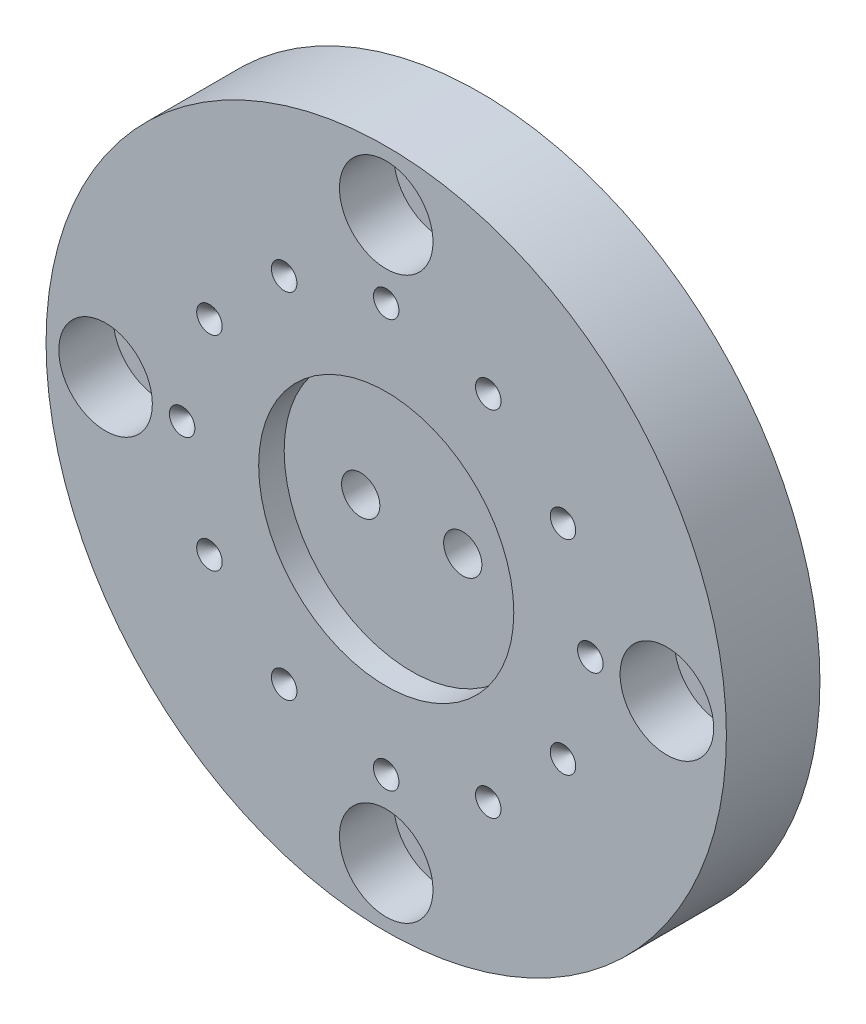
ISO-10303-21;
HEADER;
FILE_DESCRIPTION(('STEP AP214'),'2;1');
FILE_NAME('part.step','',(''),(''),'','','');
FILE_SCHEMA(('AUTOMOTIVE_DESIGN { 1 0 10303 214 1 1 1 1 }'));
ENDSEC;
DATA;
#1=APPLICATION_CONTEXT('core data for automotive mechanical design processes');
#2=APPLICATION_PROTOCOL_DEFINITION('international standard','automotive_design',2000,#1);
#3=PRODUCT_CONTEXT('',#1,'mechanical');
#4=PRODUCT('Part','Part','',(#3));
#5=PRODUCT_RELATED_PRODUCT_CATEGORY('part','',(#4));
#6=PRODUCT_DEFINITION_FORMATION('','',#4);
#7=PRODUCT_DEFINITION_CONTEXT('part definition',#1,'design');
#8=PRODUCT_DEFINITION('design','',#6,#7);
#9=PRODUCT_DEFINITION_SHAPE('','',#8);
#10=(LENGTH_UNIT() NAMED_UNIT(*) SI_UNIT(.MILLI.,.METRE.));
#11=(NAMED_UNIT(*) PLANE_ANGLE_UNIT() SI_UNIT($,.RADIAN.));
#12=(NAMED_UNIT(*) SI_UNIT($,.STERADIAN.) SOLID_ANGLE_UNIT());
#13=UNCERTAINTY_MEASURE_WITH_UNIT(LENGTH_MEASURE(1.E-05),#10,'distance_accuracy_value','');
#14=(GEOMETRIC_REPRESENTATION_CONTEXT(3) GLOBAL_UNCERTAINTY_ASSIGNED_CONTEXT((#13)) GLOBAL_UNIT_ASSIGNED_CONTEXT((#10,
#11,#12)) REPRESENTATION_CONTEXT('',''));
#15=CARTESIAN_POINT('',(0.,0.,0.));
#16=DIRECTION('',(0.,0.,1.));
#17=DIRECTION('',(1.,0.,0.));
#18=AXIS2_PLACEMENT_3D('',#15,#16,#17);
#19=CARTESIAN_POINT('',(0.,0.,8.));
#20=DIRECTION('',(0.,0.,1.));
#21=DIRECTION('',(1.,0.,0.));
#22=AXIS2_PLACEMENT_3D('',#19,#20,#21);
#23=PLANE('',#22);
#24=CARTESIAN_POINT('',(-6.,0.,8.));
#25=DIRECTION('',(0.,0.,-1.));
#26=DIRECTION('',(-1.,0.,0.));
#27=AXIS2_PLACEMENT_3D('',#24,#25,#26);
#28=CIRCLE('',#27,2.25);
#29=CARTESIAN_POINT('',(-8.25,0.,8.));
#30=VERTEX_POINT('',#29);
#31=EDGE_CURVE('E227',#30,#30,#28,.T.);
#32=ORIENTED_EDGE('',*,*,#31,.T.);
#33=EDGE_LOOP('',(#32));
#34=FACE_BOUND('',#33,.T.);
#35=CARTESIAN_POINT('',(6.,0.,8.));
#36=DIRECTION('',(0.,0.,-1.));
#37=DIRECTION('',(-1.,0.,0.));
#38=AXIS2_PLACEMENT_3D('',#35,#36,#37);
#39=CIRCLE('',#38,2.25);
#40=CARTESIAN_POINT('',(3.75,0.,8.));
#41=VERTEX_POINT('',#40);
#42=EDGE_CURVE('E229',#41,#41,#39,.T.);
#43=ORIENTED_EDGE('',*,*,#42,.T.);
#44=EDGE_LOOP('',(#43));
#45=FACE_BOUND('',#44,.T.);
#46=CARTESIAN_POINT('',(0.,0.,8.));
#47=DIRECTION('',(0.,0.,1.));
#48=DIRECTION('',(1.,0.,0.));
#49=AXIS2_PLACEMENT_3D('',#46,#47,#48);
#50=CIRCLE('',#49,15.);
#51=CARTESIAN_POINT('',(15.,0.,8.));
#52=VERTEX_POINT('',#51);
#53=EDGE_CURVE('E19',#52,#52,#50,.T.);
#54=ORIENTED_EDGE('',*,*,#53,.T.);
#55=EDGE_LOOP('',(#54));
#56=FACE_BOUND('',#55,.T.);
#57=ADVANCED_FACE('F16',(#34,#45,#56),#23,.T.);
#58=CARTESIAN_POINT('',(-12.,20.78460969083,10.9999999999104));
#59=DIRECTION('',(0.,0.,1.));
#60=DIRECTION('',(1.,0.,0.));
#61=AXIS2_PLACEMENT_3D('',#58,#59,#60);
#62=CONICAL_SURFACE('',#61,1.49999999988113,0.785398163230657);
#63=CARTESIAN_POINT('',(-12.,20.78460969083,11.0000000000241));
#64=DIRECTION('',(0.,0.,1.));
#65=DIRECTION('',(1.,0.,0.));
#66=AXIS2_PLACEMENT_3D('',#63,#64,#65);
#67=CIRCLE('',#66,1.49999999999482);
#68=CARTESIAN_POINT('',(-10.5000000000052,20.78460969083,11.0000000000241));
#69=VERTEX_POINT('',#68);
#70=EDGE_CURVE('E221',#69,#69,#67,.F.);
#71=ORIENTED_EDGE('',*,*,#70,.F.);
#72=EDGE_LOOP('',(#71));
#73=FACE_BOUND('',#72,.T.);
#74=CARTESIAN_POINT('',(-12.,20.78460969083,9.49999999994589));
#75=VERTEX_POINT('',#74);
#76=VERTEX_LOOP('',#75);
#77=FACE_BOUND('',#76,.T.);
#78=ADVANCED_FACE('F62',(#73,#77),#62,.F.);
#79=CARTESIAN_POINT('',(-20.78460969083,12.,10.9999999999104));
#80=DIRECTION('',(0.,0.,1.));
#81=DIRECTION('',(1.,0.,0.));
#82=AXIS2_PLACEMENT_3D('',#79,#80,#81);
#83=CONICAL_SURFACE('',#82,1.49999999989062,0.785398163196167);
#84=CARTESIAN_POINT('',(-20.78460969083,12.,11.0000000000241));
#85=DIRECTION('',(0.,0.,1.));
#86=DIRECTION('',(1.,0.,0.));
#87=AXIS2_PLACEMENT_3D('',#84,#85,#86);
#88=CIRCLE('',#87,1.50000000000431);
#89=CARTESIAN_POINT('',(-19.2846096908257,12.,11.0000000000241));
#90=VERTEX_POINT('',#89);
#91=EDGE_CURVE('E215',#90,#90,#88,.F.);
#92=ORIENTED_EDGE('',*,*,#91,.F.);
#93=EDGE_LOOP('',(#92));
#94=FACE_BOUND('',#93,.T.);
#95=CARTESIAN_POINT('',(-20.78460969083,12.,9.49999999988904));
#96=VERTEX_POINT('',#95);
#97=VERTEX_LOOP('',#96);
#98=FACE_BOUND('',#97,.T.);
#99=ADVANCED_FACE('F64',(#94,#98),#83,.F.);
#100=CARTESIAN_POINT('',(-24.,2.51426483799388E-13,10.9999999999673));
#101=DIRECTION('',(0.,0.,1.));
#102=DIRECTION('',(1.,0.,0.));
#103=AXIS2_PLACEMENT_3D('',#100,#101,#102);
#104=CONICAL_SURFACE('',#103,1.49999999990743,0.785398163283594);
#105=CARTESIAN_POINT('',(-24.,2.51426483799388E-13,11.0000000000241));
#106=DIRECTION('',(0.,0.,1.));
#107=DIRECTION('',(1.,0.,0.));
#108=AXIS2_PLACEMENT_3D('',#105,#106,#107);
#109=CIRCLE('',#108,1.49999999996428);
#110=CARTESIAN_POINT('',(-22.5000000000357,2.51426483799388E-13,11.0000000000241));
#111=VERTEX_POINT('',#110);
#112=EDGE_CURVE('E212',#111,#111,#109,.F.);
#113=ORIENTED_EDGE('',*,*,#112,.F.);
#114=EDGE_LOOP('',(#113));
#115=FACE_BOUND('',#114,.T.);
#116=CARTESIAN_POINT('',(-24.,-5.6843418860808E-11,9.49999999997431));
#117=VERTEX_POINT('',#116);
#118=VERTEX_LOOP('',#117);
#119=FACE_BOUND('',#118,.T.);
#120=ADVANCED_FACE('F71',(#115,#119),#104,.F.);
#121=CARTESIAN_POINT('',(-20.78460969083,-12.,10.9999999999104));
#122=DIRECTION('',(0.,0.,1.));
#123=DIRECTION('',(1.,0.,0.));
#124=AXIS2_PLACEMENT_3D('',#121,#122,#123);
#125=CONICAL_SURFACE('',#124,1.49999999988113,0.785398163230657);
#126=CARTESIAN_POINT('',(-20.78460969083,-12.,11.0000000000241));
#127=DIRECTION('',(0.,0.,1.));
#128=DIRECTION('',(1.,0.,0.));
#129=AXIS2_PLACEMENT_3D('',#126,#127,#128);
#130=CIRCLE('',#129,1.49999999999482);
#131=CARTESIAN_POINT('',(-19.2846096908352,-12.,11.0000000000241));
#132=VERTEX_POINT('',#131);
#133=EDGE_CURVE('E214',#132,#132,#130,.F.);
#134=ORIENTED_EDGE('',*,*,#133,.F.);
#135=EDGE_LOOP('',(#134));
#136=FACE_BOUND('',#135,.T.);
#137=CARTESIAN_POINT('',(-20.78460969083,-12.,9.49999999994589));
#138=VERTEX_POINT('',#137);
#139=VERTEX_LOOP('',#138);
#140=FACE_BOUND('',#139,.T.);
#141=ADVANCED_FACE('F200',(#136,#140),#125,.F.);
#142=CARTESIAN_POINT('',(-12.,-20.78460969083,10.9999999999104));
#143=DIRECTION('',(0.,0.,1.));
#144=DIRECTION('',(1.,0.,0.));
#145=AXIS2_PLACEMENT_3D('',#142,#143,#144);
#146=CONICAL_SURFACE('',#145,1.49999999989062,0.785398163196167);
#147=CARTESIAN_POINT('',(-12.,-20.78460969083,11.0000000000241));
#148=DIRECTION('',(0.,0.,1.));
#149=DIRECTION('',(1.,0.,0.));
#150=AXIS2_PLACEMENT_3D('',#147,#148,#149);
#151=CIRCLE('',#150,1.50000000000431);
#152=CARTESIAN_POINT('',(-10.4999999999957,-20.78460969083,11.0000000000241));
#153=VERTEX_POINT('',#152);
#154=EDGE_CURVE('E218',#153,#153,#151,.F.);
#155=ORIENTED_EDGE('',*,*,#154,.F.);
#156=EDGE_LOOP('',(#155));
#157=FACE_BOUND('',#156,.T.);
#158=CARTESIAN_POINT('',(-12.,-20.78460969083,9.49999999988904));
#159=VERTEX_POINT('',#158);
#160=VERTEX_LOOP('',#159);
#161=FACE_BOUND('',#160,.T.);
#162=ADVANCED_FACE('F196',(#157,#161),#146,.F.);
#163=CARTESIAN_POINT('',(-1.67617655866259E-13,-24.,10.9999999999673));
#164=DIRECTION('',(0.,0.,1.));
#165=DIRECTION('',(1.,0.,0.));
#166=AXIS2_PLACEMENT_3D('',#163,#164,#165);
#167=CONICAL_SURFACE('',#166,1.49999999990752,0.78539816328365);
#168=CARTESIAN_POINT('',(-1.67617655866259E-13,-24.,11.0000000000241));
#169=DIRECTION('',(0.,0.,1.));
#170=DIRECTION('',(1.,0.,0.));
#171=AXIS2_PLACEMENT_3D('',#168,#169,#170);
#172=CIRCLE('',#171,1.49999999996436);
#173=CARTESIAN_POINT('',(1.49999999996419,-24.,11.0000000000241));
#174=VERTEX_POINT('',#173);
#175=EDGE_CURVE('E304',#174,#174,#172,.F.);
#176=ORIENTED_EDGE('',*,*,#175,.F.);
#177=EDGE_LOOP('',(#176));
#178=FACE_BOUND('',#177,.T.);
#179=CARTESIAN_POINT('',(5.6843418860808E-11,-24.,9.49999999997431));
#180=VERTEX_POINT('',#179);
#181=VERTEX_LOOP('',#180);
#182=FACE_BOUND('',#181,.T.);
#183=ADVANCED_FACE('F192',(#178,#182),#167,.F.);
#184=CARTESIAN_POINT('',(12.,-20.78460969083,10.9999999999104));
#185=DIRECTION('',(0.,0.,1.));
#186=DIRECTION('',(1.,0.,0.));
#187=AXIS2_PLACEMENT_3D('',#184,#185,#186);
#188=CONICAL_SURFACE('',#187,1.49999999988113,0.785398163230657);
#189=CARTESIAN_POINT('',(12.,-20.78460969083,11.0000000000241));
#190=DIRECTION('',(0.,0.,1.));
#191=DIRECTION('',(1.,0.,0.));
#192=AXIS2_PLACEMENT_3D('',#189,#190,#191);
#193=CIRCLE('',#192,1.49999999999482);
#194=CARTESIAN_POINT('',(13.4999999999948,-20.78460969083,11.0000000000241));
#195=VERTEX_POINT('',#194);
#196=EDGE_CURVE('E301',#195,#195,#193,.F.);
#197=ORIENTED_EDGE('',*,*,#196,.F.);
#198=EDGE_LOOP('',(#197));
#199=FACE_BOUND('',#198,.T.);
#200=CARTESIAN_POINT('',(12.,-20.78460969083,9.49999999994589));
#201=VERTEX_POINT('',#200);
#202=VERTEX_LOOP('',#201);
#203=FACE_BOUND('',#202,.T.);
#204=ADVANCED_FACE('F188',(#199,#203),#188,.F.);
#205=CARTESIAN_POINT('',(20.78460969083,-12.,10.9999999999104));
#206=DIRECTION('',(0.,0.,1.));
#207=DIRECTION('',(1.,0.,0.));
#208=AXIS2_PLACEMENT_3D('',#205,#206,#207);
#209=CONICAL_SURFACE('',#208,1.49999999989062,0.785398163196167);
#210=CARTESIAN_POINT('',(20.78460969083,-12.,11.0000000000241));
#211=DIRECTION('',(0.,0.,1.));
#212=DIRECTION('',(1.,0.,0.));
#213=AXIS2_PLACEMENT_3D('',#210,#211,#212);
#214=CIRCLE('',#213,1.50000000000431);
#215=CARTESIAN_POINT('',(22.2846096908343,-12.,11.0000000000241));
#216=VERTEX_POINT('',#215);
#217=EDGE_CURVE('E298',#216,#216,#214,.F.);
#218=ORIENTED_EDGE('',*,*,#217,.F.);
#219=EDGE_LOOP('',(#218));
#220=FACE_BOUND('',#219,.T.);
#221=CARTESIAN_POINT('',(20.78460969083,-12.,9.49999999988904));
#222=VERTEX_POINT('',#221);
#223=VERTEX_LOOP('',#222);
#224=FACE_BOUND('',#223,.T.);
#225=ADVANCED_FACE('F184',(#220,#224),#209,.F.);
#226=CARTESIAN_POINT('',(24.,0.,10.9999999999673));
#227=DIRECTION('',(0.,0.,1.));
#228=DIRECTION('',(1.,0.,0.));
#229=AXIS2_PLACEMENT_3D('',#226,#227,#228);
#230=CONICAL_SURFACE('',#229,1.4999999999076,0.785398163283706);
#231=CARTESIAN_POINT('',(24.,0.,11.0000000000241));
#232=DIRECTION('',(0.,0.,1.));
#233=DIRECTION('',(1.,0.,0.));
#234=AXIS2_PLACEMENT_3D('',#231,#232,#233);
#235=CIRCLE('',#234,1.49999999996445);
#236=CARTESIAN_POINT('',(25.4999999999644,0.,11.0000000000241));
#237=VERTEX_POINT('',#236);
#238=EDGE_CURVE('E295',#237,#237,#235,.F.);
#239=ORIENTED_EDGE('',*,*,#238,.F.);
#240=EDGE_LOOP('',(#239));
#241=FACE_BOUND('',#240,.T.);
#242=CARTESIAN_POINT('',(24.,5.6843418860808E-11,9.49999999997431));
#243=VERTEX_POINT('',#242);
#244=VERTEX_LOOP('',#243);
#245=FACE_BOUND('',#244,.T.);
#246=ADVANCED_FACE('F180',(#241,#245),#230,.F.);
#247=CARTESIAN_POINT('',(20.78460969083,12.,10.9999999999104));
#248=DIRECTION('',(0.,0.,1.));
#249=DIRECTION('',(1.,0.,0.));
#250=AXIS2_PLACEMENT_3D('',#247,#248,#249);
#251=CONICAL_SURFACE('',#250,1.49999999988113,0.785398163230657);
#252=CARTESIAN_POINT('',(20.78460969083,12.,11.0000000000241));
#253=DIRECTION('',(0.,0.,1.));
#254=DIRECTION('',(1.,0.,0.));
#255=AXIS2_PLACEMENT_3D('',#252,#253,#254);
#256=CIRCLE('',#255,1.49999999999482);
#257=CARTESIAN_POINT('',(22.2846096908248,12.,11.0000000000241));
#258=VERTEX_POINT('',#257);
#259=EDGE_CURVE('E292',#258,#258,#256,.F.);
#260=ORIENTED_EDGE('',*,*,#259,.F.);
#261=EDGE_LOOP('',(#260));
#262=FACE_BOUND('',#261,.T.);
#263=CARTESIAN_POINT('',(20.78460969083,12.,9.49999999994589));
#264=VERTEX_POINT('',#263);
#265=VERTEX_LOOP('',#264);
#266=FACE_BOUND('',#265,.T.);
#267=ADVANCED_FACE('F176',(#262,#266),#251,.F.);
#268=CARTESIAN_POINT('',(12.,20.78460969083,10.9999999999104));
#269=DIRECTION('',(0.,0.,1.));
#270=DIRECTION('',(1.,0.,0.));
#271=AXIS2_PLACEMENT_3D('',#268,#269,#270);
#272=CONICAL_SURFACE('',#271,1.49999999989062,0.785398163196167);
#273=CARTESIAN_POINT('',(12.,20.78460969083,11.0000000000241));
#274=DIRECTION('',(0.,0.,1.));
#275=DIRECTION('',(1.,0.,0.));
#276=AXIS2_PLACEMENT_3D('',#273,#274,#275);
#277=CIRCLE('',#276,1.50000000000431);
#278=CARTESIAN_POINT('',(13.5000000000043,20.78460969083,11.0000000000241));
#279=VERTEX_POINT('',#278);
#280=EDGE_CURVE('E289',#279,#279,#277,.F.);
#281=ORIENTED_EDGE('',*,*,#280,.F.);
#282=EDGE_LOOP('',(#281));
#283=FACE_BOUND('',#282,.T.);
#284=CARTESIAN_POINT('',(12.,20.78460969083,9.49999999988904));
#285=VERTEX_POINT('',#284);
#286=VERTEX_LOOP('',#285);
#287=FACE_BOUND('',#286,.T.);
#288=ADVANCED_FACE('F172',(#283,#287),#272,.F.);
#289=CARTESIAN_POINT('',(0.,0.,8.));
#290=DIRECTION('',(0.,0.,1.));
#291=DIRECTION('',(1.,0.,0.));
#292=AXIS2_PLACEMENT_3D('',#289,#290,#291);
#293=CYLINDRICAL_SURFACE('',#292,15.);
#294=CARTESIAN_POINT('',(0.,0.,11.));
#295=DIRECTION('',(0.,0.,1.));
#296=DIRECTION('',(1.,0.,0.));
#297=AXIS2_PLACEMENT_3D('',#294,#295,#296);
#298=CIRCLE('',#297,15.);
#299=CARTESIAN_POINT('',(15.,0.,11.));
#300=VERTEX_POINT('',#299);
#301=EDGE_CURVE('E277',#300,#300,#298,.F.);
#302=ORIENTED_EDGE('',*,*,#301,.F.);
#303=EDGE_LOOP('',(#302));
#304=FACE_BOUND('',#303,.T.);
#305=ORIENTED_EDGE('',*,*,#53,.F.);
#306=EDGE_LOOP('',(#305));
#307=FACE_BOUND('',#306,.T.);
#308=ADVANCED_FACE('F168',(#304,#307),#293,.F.);
#309=CARTESIAN_POINT('',(0.,24.,10.9999999999673));
#310=DIRECTION('',(0.,0.,1.));
#311=DIRECTION('',(1.,0.,0.));
#312=AXIS2_PLACEMENT_3D('',#309,#310,#311);
#313=CONICAL_SURFACE('',#312,1.49999999990769,0.785398163283761);
#314=CARTESIAN_POINT('',(0.,24.,11.0000000000241));
#315=DIRECTION('',(0.,0.,1.));
#316=DIRECTION('',(1.,0.,0.));
#317=AXIS2_PLACEMENT_3D('',#314,#315,#316);
#318=CIRCLE('',#317,1.49999999996453);
#319=CARTESIAN_POINT('',(1.49999999996453,24.,11.0000000000241));
#320=VERTEX_POINT('',#319);
#321=EDGE_CURVE('E271',#320,#320,#318,.F.);
#322=ORIENTED_EDGE('',*,*,#321,.F.);
#323=EDGE_LOOP('',(#322));
#324=FACE_BOUND('',#323,.T.);
#325=CARTESIAN_POINT('',(-5.6843418860808E-11,24.,9.49999999997431));
#326=VERTEX_POINT('',#325);
#327=VERTEX_LOOP('',#326);
#328=FACE_BOUND('',#327,.T.);
#329=ADVANCED_FACE('F164',(#324,#328),#313,.F.);
#330=CARTESIAN_POINT('',(-3.456568527498E-13,-33.,11.));
#331=DIRECTION('',(0.,0.,1.));
#332=DIRECTION('',(1.,0.,0.));
#333=AXIS2_PLACEMENT_3D('',#330,#331,#332);
#334=CYLINDRICAL_SURFACE('',#333,5.5);
#335=CARTESIAN_POINT('',(-3.456568527498E-13,-33.,11.));
#336=DIRECTION('',(0.,0.,1.));
#337=DIRECTION('',(1.,0.,0.));
#338=AXIS2_PLACEMENT_3D('',#335,#336,#337);
#339=CIRCLE('',#338,5.5);
#340=CARTESIAN_POINT('',(5.49999999999965,-33.,11.));
#341=VERTEX_POINT('',#340);
#342=EDGE_CURVE('E286',#341,#341,#339,.F.);
#343=ORIENTED_EDGE('',*,*,#342,.F.);
#344=EDGE_LOOP('',(#343));
#345=FACE_BOUND('',#344,.T.);
#346=CARTESIAN_POINT('',(-3.456568527498E-13,-33.,4.6));
#347=DIRECTION('',(0.,0.,1.));
#348=DIRECTION('',(1.,0.,0.));
#349=AXIS2_PLACEMENT_3D('',#346,#347,#348);
#350=CIRCLE('',#349,5.5);
#351=CARTESIAN_POINT('',(5.49999999999965,-33.,4.6));
#352=VERTEX_POINT('',#351);
#353=EDGE_CURVE('E268',#352,#352,#350,.F.);
#354=ORIENTED_EDGE('',*,*,#353,.T.);
#355=EDGE_LOOP('',(#354));
#356=FACE_BOUND('',#355,.T.);
#357=ADVANCED_FACE('F160',(#345,#356),#334,.F.);
#358=CARTESIAN_POINT('',(33.,-2.304379018332E-13,11.));
#359=DIRECTION('',(0.,0.,1.));
#360=DIRECTION('',(1.,0.,0.));
#361=AXIS2_PLACEMENT_3D('',#358,#359,#360);
#362=CYLINDRICAL_SURFACE('',#361,5.5);
#363=CARTESIAN_POINT('',(33.,-2.304379018332E-13,11.));
#364=DIRECTION('',(0.,0.,1.));
#365=DIRECTION('',(1.,0.,0.));
#366=AXIS2_PLACEMENT_3D('',#363,#364,#365);
#367=CIRCLE('',#366,5.5);
#368=CARTESIAN_POINT('',(38.5,-2.304379018332E-13,11.));
#369=VERTEX_POINT('',#368);
#370=EDGE_CURVE('E283',#369,#369,#367,.F.);
#371=ORIENTED_EDGE('',*,*,#370,.F.);
#372=EDGE_LOOP('',(#371));
#373=FACE_BOUND('',#372,.T.);
#374=CARTESIAN_POINT('',(33.,-2.304379018332E-13,4.6));
#375=DIRECTION('',(0.,0.,1.));
#376=DIRECTION('',(1.,0.,0.));
#377=AXIS2_PLACEMENT_3D('',#374,#375,#376);
#378=CIRCLE('',#377,5.5);
#379=CARTESIAN_POINT('',(38.5,-2.304379018332E-13,4.6));
#380=VERTEX_POINT('',#379);
#381=EDGE_CURVE('E265',#380,#380,#378,.F.);
#382=ORIENTED_EDGE('',*,*,#381,.T.);
#383=EDGE_LOOP('',(#382));
#384=FACE_BOUND('',#383,.T.);
#385=ADVANCED_FACE('F156',(#373,#384),#362,.F.);
#386=CARTESIAN_POINT('',(1.152189509166E-13,33.,11.));
#387=DIRECTION('',(0.,0.,1.));
#388=DIRECTION('',(1.,0.,0.));
#389=AXIS2_PLACEMENT_3D('',#386,#387,#388);
#390=CYLINDRICAL_SURFACE('',#389,5.5);
#391=CARTESIAN_POINT('',(1.152189509166E-13,33.,11.));
#392=DIRECTION('',(0.,0.,1.));
#393=DIRECTION('',(1.,0.,0.));
#394=AXIS2_PLACEMENT_3D('',#391,#392,#393);
#395=CIRCLE('',#394,5.5);
#396=CARTESIAN_POINT('',(5.50000000000012,33.,11.));
#397=VERTEX_POINT('',#396);
#398=EDGE_CURVE('E280',#397,#397,#395,.F.);
#399=ORIENTED_EDGE('',*,*,#398,.F.);
#400=EDGE_LOOP('',(#399));
#401=FACE_BOUND('',#400,.T.);
#402=CARTESIAN_POINT('',(1.152189509166E-13,33.,4.6));
#403=DIRECTION('',(0.,0.,1.));
#404=DIRECTION('',(1.,0.,0.));
#405=AXIS2_PLACEMENT_3D('',#402,#403,#404);
#406=CIRCLE('',#405,5.5);
#407=CARTESIAN_POINT('',(5.50000000000012,33.,4.6));
#408=VERTEX_POINT('',#407);
#409=EDGE_CURVE('E262',#408,#408,#406,.F.);
#410=ORIENTED_EDGE('',*,*,#409,.T.);
#411=EDGE_LOOP('',(#410));
#412=FACE_BOUND('',#411,.T.);
#413=ADVANCED_FACE('F152',(#401,#412),#390,.F.);
#414=CARTESIAN_POINT('',(6.,0.,0.));
#415=DIRECTION('',(0.,0.,-1.));
#416=DIRECTION('',(-1.,0.,0.));
#417=AXIS2_PLACEMENT_3D('',#414,#415,#416);
#418=CYLINDRICAL_SURFACE('',#417,2.25);
#419=CARTESIAN_POINT('',(6.,0.,4.4));
#420=DIRECTION('',(0.,0.,-1.));
#421=DIRECTION('',(-1.,0.,0.));
#422=AXIS2_PLACEMENT_3D('',#419,#420,#421);
#423=CIRCLE('',#422,2.25);
#424=CARTESIAN_POINT('',(3.75,0.,4.4));
#425=VERTEX_POINT('',#424);
#426=EDGE_CURVE('E259',#425,#425,#423,.T.);
#427=ORIENTED_EDGE('',*,*,#426,.T.);
#428=EDGE_LOOP('',(#427));
#429=FACE_BOUND('',#428,.T.);
#430=ORIENTED_EDGE('',*,*,#42,.F.);
#431=EDGE_LOOP('',(#430));
#432=FACE_BOUND('',#431,.T.);
#433=ADVANCED_FACE('F148',(#429,#432),#418,.F.);
#434=CARTESIAN_POINT('',(-6.,0.,0.));
#435=DIRECTION('',(0.,0.,-1.));
#436=DIRECTION('',(-1.,0.,0.));
#437=AXIS2_PLACEMENT_3D('',#434,#435,#436);
#438=CYLINDRICAL_SURFACE('',#437,2.25);
#439=CARTESIAN_POINT('',(-6.,0.,4.4));
#440=DIRECTION('',(0.,0.,-1.));
#441=DIRECTION('',(-1.,0.,0.));
#442=AXIS2_PLACEMENT_3D('',#439,#440,#441);
#443=CIRCLE('',#442,2.25);
#444=CARTESIAN_POINT('',(-8.25,0.,4.4));
#445=VERTEX_POINT('',#444);
#446=EDGE_CURVE('E253',#445,#445,#443,.T.);
#447=ORIENTED_EDGE('',*,*,#446,.T.);
#448=EDGE_LOOP('',(#447));
#449=FACE_BOUND('',#448,.T.);
#450=ORIENTED_EDGE('',*,*,#31,.F.);
#451=EDGE_LOOP('',(#450));
#452=FACE_BOUND('',#451,.T.);
#453=ADVANCED_FACE('F144',(#449,#452),#438,.F.);
#454=CARTESIAN_POINT('',(-33.,0.,11.));
#455=DIRECTION('',(0.,0.,1.));
#456=DIRECTION('',(1.,0.,0.));
#457=AXIS2_PLACEMENT_3D('',#454,#455,#456);
#458=CYLINDRICAL_SURFACE('',#457,5.5);
#459=CARTESIAN_POINT('',(-33.,0.,11.));
#460=DIRECTION('',(0.,0.,1.));
#461=DIRECTION('',(1.,0.,0.));
#462=AXIS2_PLACEMENT_3D('',#459,#460,#461);
#463=CIRCLE('',#462,5.5);
#464=CARTESIAN_POINT('',(-27.5,0.,11.));
#465=VERTEX_POINT('',#464);
#466=EDGE_CURVE('E274',#465,#465,#463,.F.);
#467=ORIENTED_EDGE('',*,*,#466,.F.);
#468=EDGE_LOOP('',(#467));
#469=FACE_BOUND('',#468,.T.);
#470=CARTESIAN_POINT('',(-33.,0.,4.6));
#471=DIRECTION('',(0.,0.,1.));
#472=DIRECTION('',(1.,0.,0.));
#473=AXIS2_PLACEMENT_3D('',#470,#471,#472);
#474=CIRCLE('',#473,5.5);
#475=CARTESIAN_POINT('',(-27.5,0.,4.6));
#476=VERTEX_POINT('',#475);
#477=EDGE_CURVE('E247',#476,#476,#474,.F.);
#478=ORIENTED_EDGE('',*,*,#477,.T.);
#479=EDGE_LOOP('',(#478));
#480=FACE_BOUND('',#479,.T.);
#481=ADVANCED_FACE('F140',(#469,#480),#458,.F.);
#482=CARTESIAN_POINT('',(0.,0.,11.));
#483=DIRECTION('',(0.,0.,1.));
#484=DIRECTION('',(1.,0.,0.));
#485=AXIS2_PLACEMENT_3D('',#482,#483,#484);
#486=PLANE('',#485);
#487=ORIENTED_EDGE('',*,*,#321,.T.);
#488=EDGE_LOOP('',(#487));
#489=FACE_BOUND('',#488,.T.);
#490=ORIENTED_EDGE('',*,*,#466,.T.);
#491=EDGE_LOOP('',(#490));
#492=FACE_BOUND('',#491,.T.);
#493=ORIENTED_EDGE('',*,*,#301,.T.);
#494=EDGE_LOOP('',(#493));
#495=FACE_BOUND('',#494,.T.);
#496=ORIENTED_EDGE('',*,*,#398,.T.);
#497=EDGE_LOOP('',(#496));
#498=FACE_BOUND('',#497,.T.);
#499=ORIENTED_EDGE('',*,*,#370,.T.);
#500=EDGE_LOOP('',(#499));
#501=FACE_BOUND('',#500,.T.);
#502=ORIENTED_EDGE('',*,*,#342,.T.);
#503=EDGE_LOOP('',(#502));
#504=FACE_BOUND('',#503,.T.);
#505=ORIENTED_EDGE('',*,*,#280,.T.);
#506=EDGE_LOOP('',(#505));
#507=FACE_BOUND('',#506,.T.);
#508=ORIENTED_EDGE('',*,*,#259,.T.);
#509=EDGE_LOOP('',(#508));
#510=FACE_BOUND('',#509,.T.);
#511=ORIENTED_EDGE('',*,*,#238,.T.);
#512=EDGE_LOOP('',(#511));
#513=FACE_BOUND('',#512,.T.);
#514=ORIENTED_EDGE('',*,*,#217,.T.);
#515=EDGE_LOOP('',(#514));
#516=FACE_BOUND('',#515,.T.);
#517=ORIENTED_EDGE('',*,*,#196,.T.);
#518=EDGE_LOOP('',(#517));
#519=FACE_BOUND('',#518,.T.);
#520=ORIENTED_EDGE('',*,*,#175,.T.);
#521=EDGE_LOOP('',(#520));
#522=FACE_BOUND('',#521,.T.);
#523=ORIENTED_EDGE('',*,*,#154,.T.);
#524=EDGE_LOOP('',(#523));
#525=FACE_BOUND('',#524,.T.);
#526=ORIENTED_EDGE('',*,*,#133,.T.);
#527=EDGE_LOOP('',(#526));
#528=FACE_BOUND('',#527,.T.);
#529=ORIENTED_EDGE('',*,*,#112,.T.);
#530=EDGE_LOOP('',(#529));
#531=FACE_BOUND('',#530,.T.);
#532=ORIENTED_EDGE('',*,*,#91,.T.);
#533=EDGE_LOOP('',(#532));
#534=FACE_BOUND('',#533,.T.);
#535=ORIENTED_EDGE('',*,*,#70,.T.);
#536=EDGE_LOOP('',(#535));
#537=FACE_BOUND('',#536,.T.);
#538=CARTESIAN_POINT('',(0.,0.,11.));
#539=DIRECTION('',(0.,0.,-1.));
#540=DIRECTION('',(-1.,0.,0.));
#541=AXIS2_PLACEMENT_3D('',#538,#539,#540);
#542=CIRCLE('',#541,40.);
#543=CARTESIAN_POINT('',(-40.,0.,11.));
#544=VERTEX_POINT('',#543);
#545=EDGE_CURVE('E244',#544,#544,#542,.T.);
#546=ORIENTED_EDGE('',*,*,#545,.F.);
#547=EDGE_LOOP('',(#546));
#548=FACE_BOUND('',#547,.T.);
#549=ADVANCED_FACE('F136',(#489,#492,#495,#498,#501,#504,#507,#510,#513,#516,#519,#522,#525,
#528,#531,#534,#537,#548),#486,.T.);
#550=CARTESIAN_POINT('',(3.3,-33.,4.6));
#551=DIRECTION('',(0.,0.,-1.));
#552=DIRECTION('',(-1.,0.,0.));
#553=AXIS2_PLACEMENT_3D('',#550,#551,#552);
#554=PLANE('',#553);
#555=CARTESIAN_POINT('',(-3.456568527498E-13,-33.,4.6));
#556=DIRECTION('',(0.,0.,1.));
#557=DIRECTION('',(1.,0.,0.));
#558=AXIS2_PLACEMENT_3D('',#555,#556,#557);
#559=CIRCLE('',#558,3.3);
#560=CARTESIAN_POINT('',(3.29999999999965,-33.,4.6));
#561=VERTEX_POINT('',#560);
#562=EDGE_CURVE('E246',#561,#561,#559,.F.);
#563=ORIENTED_EDGE('',*,*,#562,.T.);
#564=EDGE_LOOP('',(#563));
#565=FACE_BOUND('',#564,.T.);
#566=ORIENTED_EDGE('',*,*,#353,.F.);
#567=EDGE_LOOP('',(#566));
#568=FACE_BOUND('',#567,.T.);
#569=ADVANCED_FACE('F132',(#565,#568),#554,.F.);
#570=CARTESIAN_POINT('',(36.3,-2.304379018332E-13,4.6));
#571=DIRECTION('',(0.,0.,-1.));
#572=DIRECTION('',(-1.,0.,0.));
#573=AXIS2_PLACEMENT_3D('',#570,#571,#572);
#574=PLANE('',#573);
#575=CARTESIAN_POINT('',(33.,-2.304379018332E-13,4.6));
#576=DIRECTION('',(0.,0.,1.));
#577=DIRECTION('',(1.,0.,0.));
#578=AXIS2_PLACEMENT_3D('',#575,#576,#577);
#579=CIRCLE('',#578,3.3);
#580=CARTESIAN_POINT('',(36.3,-2.304379018332E-13,4.6));
#581=VERTEX_POINT('',#580);
#582=EDGE_CURVE('E250',#581,#581,#579,.F.);
#583=ORIENTED_EDGE('',*,*,#582,.T.);
#584=EDGE_LOOP('',(#583));
#585=FACE_BOUND('',#584,.T.);
#586=ORIENTED_EDGE('',*,*,#381,.F.);
#587=EDGE_LOOP('',(#586));
#588=FACE_BOUND('',#587,.T.);
#589=ADVANCED_FACE('F128',(#585,#588),#574,.F.);
#590=CARTESIAN_POINT('',(3.3,33.,4.6));
#591=DIRECTION('',(0.,0.,-1.));
#592=DIRECTION('',(-1.,0.,0.));
#593=AXIS2_PLACEMENT_3D('',#590,#591,#592);
#594=PLANE('',#593);
#595=CARTESIAN_POINT('',(1.152189509166E-13,33.,4.6));
#596=DIRECTION('',(0.,0.,1.));
#597=DIRECTION('',(1.,0.,0.));
#598=AXIS2_PLACEMENT_3D('',#595,#596,#597);
#599=CIRCLE('',#598,3.3);
#600=CARTESIAN_POINT('',(3.30000000000012,33.,4.6));
#601=VERTEX_POINT('',#600);
#602=EDGE_CURVE('E363',#601,#601,#599,.F.);
#603=ORIENTED_EDGE('',*,*,#602,.T.);
#604=EDGE_LOOP('',(#603));
#605=FACE_BOUND('',#604,.T.);
#606=ORIENTED_EDGE('',*,*,#409,.F.);
#607=EDGE_LOOP('',(#606));
#608=FACE_BOUND('',#607,.T.);
#609=ADVANCED_FACE('F124',(#605,#608),#594,.F.);
#610=CARTESIAN_POINT('',(8.25,0.,4.4));
#611=DIRECTION('',(0.,0.,1.));
#612=DIRECTION('',(1.,0.,0.));
#613=AXIS2_PLACEMENT_3D('',#610,#611,#612);
#614=PLANE('',#613);
#615=ORIENTED_EDGE('',*,*,#426,.F.);
#616=EDGE_LOOP('',(#615));
#617=FACE_BOUND('',#616,.T.);
#618=CARTESIAN_POINT('',(6.,0.,4.4));
#619=DIRECTION('',(0.,0.,-1.));
#620=DIRECTION('',(-1.,0.,0.));
#621=AXIS2_PLACEMENT_3D('',#618,#619,#620);
#622=CIRCLE('',#621,3.75);
#623=CARTESIAN_POINT('',(2.25,0.,4.4));
#624=VERTEX_POINT('',#623);
#625=EDGE_CURVE('E360',#624,#624,#622,.T.);
#626=ORIENTED_EDGE('',*,*,#625,.T.);
#627=EDGE_LOOP('',(#626));
#628=FACE_BOUND('',#627,.T.);
#629=ADVANCED_FACE('F120',(#617,#628),#614,.F.);
#630=CARTESIAN_POINT('',(-3.75,0.,4.4));
#631=DIRECTION('',(0.,0.,1.));
#632=DIRECTION('',(1.,0.,0.));
#633=AXIS2_PLACEMENT_3D('',#630,#631,#632);
#634=PLANE('',#633);
#635=ORIENTED_EDGE('',*,*,#446,.F.);
#636=EDGE_LOOP('',(#635));
#637=FACE_BOUND('',#636,.T.);
#638=CARTESIAN_POINT('',(-6.,0.,4.4));
#639=DIRECTION('',(0.,0.,-1.));
#640=DIRECTION('',(-1.,0.,0.));
#641=AXIS2_PLACEMENT_3D('',#638,#639,#640);
#642=CIRCLE('',#641,3.75);
#643=CARTESIAN_POINT('',(-9.75,0.,4.4));
#644=VERTEX_POINT('',#643);
#645=EDGE_CURVE('E362',#644,#644,#642,.T.);
#646=ORIENTED_EDGE('',*,*,#645,.T.);
#647=EDGE_LOOP('',(#646));
#648=FACE_BOUND('',#647,.T.);
#649=ADVANCED_FACE('F116',(#637,#648),#634,.F.);
#650=CARTESIAN_POINT('',(-29.7,0.,4.6));
#651=DIRECTION('',(0.,0.,-1.));
#652=DIRECTION('',(-1.,0.,0.));
#653=AXIS2_PLACEMENT_3D('',#650,#651,#652);
#654=PLANE('',#653);
#655=CARTESIAN_POINT('',(-33.,0.,4.6));
#656=DIRECTION('',(0.,0.,1.));
#657=DIRECTION('',(1.,0.,0.));
#658=AXIS2_PLACEMENT_3D('',#655,#656,#657);
#659=CIRCLE('',#658,3.3);
#660=CARTESIAN_POINT('',(-29.7,0.,4.6));
#661=VERTEX_POINT('',#660);
#662=EDGE_CURVE('E366',#661,#661,#659,.F.);
#663=ORIENTED_EDGE('',*,*,#662,.T.);
#664=EDGE_LOOP('',(#663));
#665=FACE_BOUND('',#664,.T.);
#666=ORIENTED_EDGE('',*,*,#477,.F.);
#667=EDGE_LOOP('',(#666));
#668=FACE_BOUND('',#667,.T.);
#669=ADVANCED_FACE('F112',(#665,#668),#654,.F.);
#670=CARTESIAN_POINT('',(0.,0.,11.));
#671=DIRECTION('',(0.,0.,-1.));
#672=DIRECTION('',(-1.,0.,0.));
#673=AXIS2_PLACEMENT_3D('',#670,#671,#672);
#674=CYLINDRICAL_SURFACE('',#673,40.);
#675=CARTESIAN_POINT('',(0.,0.,0.));
#676=DIRECTION('',(0.,0.,-1.));
#677=DIRECTION('',(-1.,0.,0.));
#678=AXIS2_PLACEMENT_3D('',#675,#676,#677);
#679=CIRCLE('',#678,40.);
#680=CARTESIAN_POINT('',(-40.,0.,0.));
#681=VERTEX_POINT('',#680);
#682=EDGE_CURVE('E385',#681,#681,#679,.F.);
#683=ORIENTED_EDGE('',*,*,#682,.T.);
#684=EDGE_LOOP('',(#683));
#685=FACE_BOUND('',#684,.T.);
#686=ORIENTED_EDGE('',*,*,#545,.T.);
#687=EDGE_LOOP('',(#686));
#688=FACE_BOUND('',#687,.T.);
#689=ADVANCED_FACE('F108',(#685,#688),#674,.T.);
#690=CARTESIAN_POINT('',(-3.456568527498E-13,-33.,11.));
#691=DIRECTION('',(0.,0.,1.));
#692=DIRECTION('',(1.,0.,0.));
#693=AXIS2_PLACEMENT_3D('',#690,#691,#692);
#694=CYLINDRICAL_SURFACE('',#693,3.3);
#695=ORIENTED_EDGE('',*,*,#562,.F.);
#696=EDGE_LOOP('',(#695));
#697=FACE_BOUND('',#696,.T.);
#698=CARTESIAN_POINT('',(-3.456568527498E-13,-33.,0.));
#699=DIRECTION('',(0.,0.,1.));
#700=DIRECTION('',(1.,0.,0.));
#701=AXIS2_PLACEMENT_3D('',#698,#699,#700);
#702=CIRCLE('',#701,3.3);
#703=CARTESIAN_POINT('',(3.29999999999965,-33.,0.));
#704=VERTEX_POINT('',#703);
#705=EDGE_CURVE('E379',#704,#704,#702,.F.);
#706=ORIENTED_EDGE('',*,*,#705,.T.);
#707=EDGE_LOOP('',(#706));
#708=FACE_BOUND('',#707,.T.);
#709=ADVANCED_FACE('F104',(#697,#708),#694,.F.);
#710=CARTESIAN_POINT('',(33.,-2.304379018332E-13,11.));
#711=DIRECTION('',(0.,0.,1.));
#712=DIRECTION('',(1.,0.,0.));
#713=AXIS2_PLACEMENT_3D('',#710,#711,#712);
#714=CYLINDRICAL_SURFACE('',#713,3.3);
#715=ORIENTED_EDGE('',*,*,#582,.F.);
#716=EDGE_LOOP('',(#715));
#717=FACE_BOUND('',#716,.T.);
#718=CARTESIAN_POINT('',(33.,-2.304379018332E-13,0.));
#719=DIRECTION('',(0.,0.,1.));
#720=DIRECTION('',(1.,0.,0.));
#721=AXIS2_PLACEMENT_3D('',#718,#719,#720);
#722=CIRCLE('',#721,3.3);
#723=CARTESIAN_POINT('',(36.3,-2.304379018332E-13,0.));
#724=VERTEX_POINT('',#723);
#725=EDGE_CURVE('E376',#724,#724,#722,.F.);
#726=ORIENTED_EDGE('',*,*,#725,.T.);
#727=EDGE_LOOP('',(#726));
#728=FACE_BOUND('',#727,.T.);
#729=ADVANCED_FACE('F100',(#717,#728),#714,.F.);
#730=CARTESIAN_POINT('',(1.152189509166E-13,33.,11.));
#731=DIRECTION('',(0.,0.,1.));
#732=DIRECTION('',(1.,0.,0.));
#733=AXIS2_PLACEMENT_3D('',#730,#731,#732);
#734=CYLINDRICAL_SURFACE('',#733,3.3);
#735=ORIENTED_EDGE('',*,*,#602,.F.);
#736=EDGE_LOOP('',(#735));
#737=FACE_BOUND('',#736,.T.);
#738=CARTESIAN_POINT('',(1.152189509166E-13,33.,0.));
#739=DIRECTION('',(0.,0.,1.));
#740=DIRECTION('',(1.,0.,0.));
#741=AXIS2_PLACEMENT_3D('',#738,#739,#740);
#742=CIRCLE('',#741,3.3);
#743=CARTESIAN_POINT('',(3.30000000000012,33.,0.));
#744=VERTEX_POINT('',#743);
#745=EDGE_CURVE('E378',#744,#744,#742,.F.);
#746=ORIENTED_EDGE('',*,*,#745,.T.);
#747=EDGE_LOOP('',(#746));
#748=FACE_BOUND('',#747,.T.);
#749=ADVANCED_FACE('F96',(#737,#748),#734,.F.);
#750=CARTESIAN_POINT('',(6.,0.,0.));
#751=DIRECTION('',(0.,0.,-1.));
#752=DIRECTION('',(-1.,0.,0.));
#753=AXIS2_PLACEMENT_3D('',#750,#751,#752);
#754=CYLINDRICAL_SURFACE('',#753,3.75);
#755=CARTESIAN_POINT('',(6.,0.,0.));
#756=DIRECTION('',(0.,0.,-1.));
#757=DIRECTION('',(-1.,0.,0.));
#758=AXIS2_PLACEMENT_3D('',#755,#756,#757);
#759=CIRCLE('',#758,3.75);
#760=CARTESIAN_POINT('',(2.25,0.,0.));
#761=VERTEX_POINT('',#760);
#762=EDGE_CURVE('E382',#761,#761,#759,.T.);
#763=ORIENTED_EDGE('',*,*,#762,.T.);
#764=EDGE_LOOP('',(#763));
#765=FACE_BOUND('',#764,.T.);
#766=ORIENTED_EDGE('',*,*,#625,.F.);
#767=EDGE_LOOP('',(#766));
#768=FACE_BOUND('',#767,.T.);
#769=ADVANCED_FACE('F92',(#765,#768),#754,.F.);
#770=CARTESIAN_POINT('',(-6.,0.,0.));
#771=DIRECTION('',(0.,0.,-1.));
#772=DIRECTION('',(-1.,0.,0.));
#773=AXIS2_PLACEMENT_3D('',#770,#771,#772);
#774=CYLINDRICAL_SURFACE('',#773,3.75);
#775=CARTESIAN_POINT('',(-6.,0.,0.));
#776=DIRECTION('',(0.,0.,-1.));
#777=DIRECTION('',(-1.,0.,0.));
#778=AXIS2_PLACEMENT_3D('',#775,#776,#777);
#779=CIRCLE('',#778,3.75);
#780=CARTESIAN_POINT('',(-9.75,0.,0.));
#781=VERTEX_POINT('',#780);
#782=EDGE_CURVE('E25',#781,#781,#779,.T.);
#783=ORIENTED_EDGE('',*,*,#782,.T.);
#784=EDGE_LOOP('',(#783));
#785=FACE_BOUND('',#784,.T.);
#786=ORIENTED_EDGE('',*,*,#645,.F.);
#787=EDGE_LOOP('',(#786));
#788=FACE_BOUND('',#787,.T.);
#789=ADVANCED_FACE('F84',(#785,#788),#774,.F.);
#790=CARTESIAN_POINT('',(-33.,0.,11.));
#791=DIRECTION('',(0.,0.,1.));
#792=DIRECTION('',(1.,0.,0.));
#793=AXIS2_PLACEMENT_3D('',#790,#791,#792);
#794=CYLINDRICAL_SURFACE('',#793,3.3);
#795=ORIENTED_EDGE('',*,*,#662,.F.);
#796=EDGE_LOOP('',(#795));
#797=FACE_BOUND('',#796,.T.);
#798=CARTESIAN_POINT('',(-33.,0.,0.));
#799=DIRECTION('',(0.,0.,1.));
#800=DIRECTION('',(1.,0.,0.));
#801=AXIS2_PLACEMENT_3D('',#798,#799,#800);
#802=CIRCLE('',#801,3.3);
#803=CARTESIAN_POINT('',(-29.7,0.,0.));
#804=VERTEX_POINT('',#803);
#805=EDGE_CURVE('E11',#804,#804,#802,.F.);
#806=ORIENTED_EDGE('',*,*,#805,.T.);
#807=EDGE_LOOP('',(#806));
#808=FACE_BOUND('',#807,.T.);
#809=ADVANCED_FACE('F78',(#797,#808),#794,.F.);
#810=CARTESIAN_POINT('',(0.,0.,0.));
#811=DIRECTION('',(0.,0.,1.));
#812=DIRECTION('',(1.,0.,0.));
#813=AXIS2_PLACEMENT_3D('',#810,#811,#812);
#814=PLANE('',#813);
#815=ORIENTED_EDGE('',*,*,#805,.F.);
#816=EDGE_LOOP('',(#815));
#817=FACE_BOUND('',#816,.T.);
#818=ORIENTED_EDGE('',*,*,#782,.F.);
#819=EDGE_LOOP('',(#818));
#820=FACE_BOUND('',#819,.T.);
#821=ORIENTED_EDGE('',*,*,#762,.F.);
#822=EDGE_LOOP('',(#821));
#823=FACE_BOUND('',#822,.T.);
#824=ORIENTED_EDGE('',*,*,#745,.F.);
#825=EDGE_LOOP('',(#824));
#826=FACE_BOUND('',#825,.T.);
#827=ORIENTED_EDGE('',*,*,#725,.F.);
#828=EDGE_LOOP('',(#827));
#829=FACE_BOUND('',#828,.T.);
#830=ORIENTED_EDGE('',*,*,#705,.F.);
#831=EDGE_LOOP('',(#830));
#832=FACE_BOUND('',#831,.T.);
#833=ORIENTED_EDGE('',*,*,#682,.F.);
#834=EDGE_LOOP('',(#833));
#835=FACE_BOUND('',#834,.T.);
#836=ADVANCED_FACE('F76',(#817,#820,#823,#826,#829,#832,#835),#814,.F.);
#837=CLOSED_SHELL('',(#57,#78,#99,#120,#141,#162,#183,#204,#225,#246,#267,#288,#308,#329,#357,
#385,#413,#433,#453,#481,#549,#569,#589,#609,#629,#649,#669,#689,#709,#729,#749,#769,#789,#809,#836));
#838=MANIFOLD_SOLID_BREP('B1',#837);
#839=ADVANCED_BREP_SHAPE_REPRESENTATION('',(#18,#838),#14);
#840=SHAPE_DEFINITION_REPRESENTATION(#9,#839);
ENDSEC;
END-ISO-10303-21;
